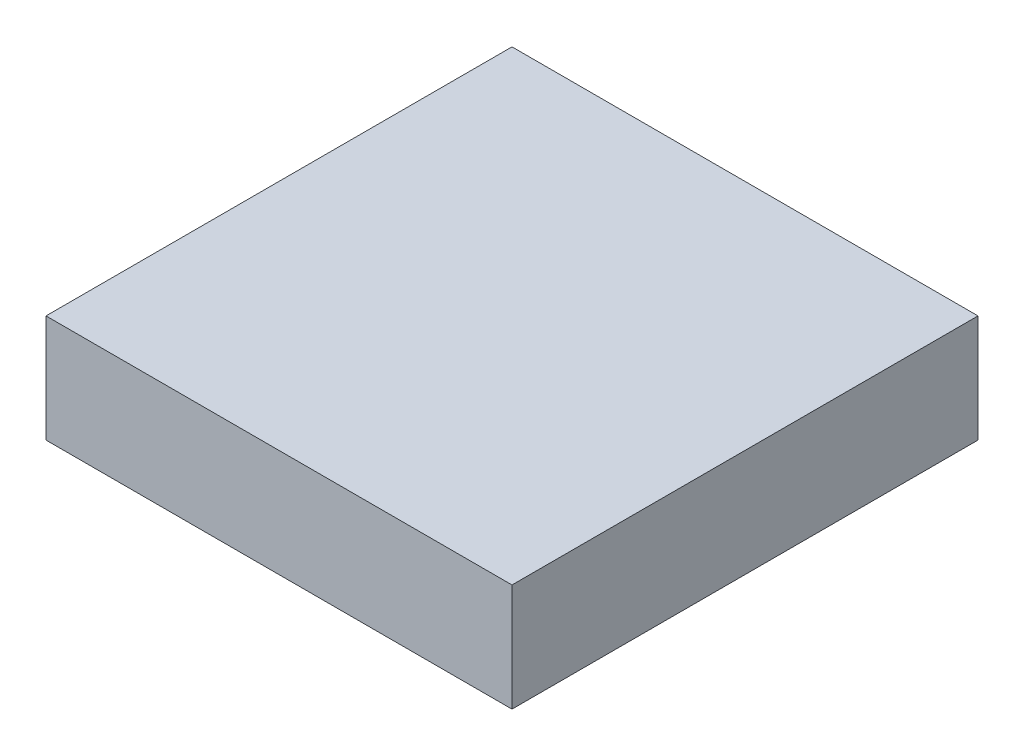
ISO-10303-21;
HEADER;
FILE_DESCRIPTION(('STEP AP214'),'2;1');
FILE_NAME('part.step','',(''),(''),'','','');
FILE_SCHEMA(('AUTOMOTIVE_DESIGN { 1 0 10303 214 1 1 1 1 }'));
ENDSEC;
DATA;
#1=APPLICATION_CONTEXT('core data for automotive mechanical design processes');
#2=APPLICATION_PROTOCOL_DEFINITION('international standard','automotive_design',2000,#1);
#3=PRODUCT_CONTEXT('',#1,'mechanical');
#4=PRODUCT('Part','Part','',(#3));
#5=PRODUCT_RELATED_PRODUCT_CATEGORY('part','',(#4));
#6=PRODUCT_DEFINITION_FORMATION('','',#4);
#7=PRODUCT_DEFINITION_CONTEXT('part definition',#1,'design');
#8=PRODUCT_DEFINITION('design','',#6,#7);
#9=PRODUCT_DEFINITION_SHAPE('','',#8);
#10=(LENGTH_UNIT() NAMED_UNIT(*) SI_UNIT(.MILLI.,.METRE.));
#11=(NAMED_UNIT(*) PLANE_ANGLE_UNIT() SI_UNIT($,.RADIAN.));
#12=(NAMED_UNIT(*) SI_UNIT($,.STERADIAN.) SOLID_ANGLE_UNIT());
#13=UNCERTAINTY_MEASURE_WITH_UNIT(LENGTH_MEASURE(1.E-05),#10,'distance_accuracy_value','');
#14=(GEOMETRIC_REPRESENTATION_CONTEXT(3) GLOBAL_UNCERTAINTY_ASSIGNED_CONTEXT((#13)) GLOBAL_UNIT_ASSIGNED_CONTEXT((#10,
#11,#12)) REPRESENTATION_CONTEXT('',''));
#15=CARTESIAN_POINT('',(0.,0.,0.));
#16=DIRECTION('',(0.,0.,1.));
#17=DIRECTION('',(1.,0.,0.));
#18=AXIS2_PLACEMENT_3D('',#15,#16,#17);
#19=CARTESIAN_POINT('',(0.,27.7,0.));
#20=DIRECTION('',(1.,0.,0.));
#21=DIRECTION('',(0.,0.,-1.));
#22=AXIS2_PLACEMENT_3D('',#19,#20,#21);
#23=PLANE('',#22);
#24=DIRECTION('',(0.,0.,1.));
#25=VECTOR('',#24,1.);
#26=CARTESIAN_POINT('',(0.,0.,0.));
#27=LINE('',#26,#25);
#28=CARTESIAN_POINT('',(0.,0.,-120.));
#29=VERTEX_POINT('',#28);
#30=CARTESIAN_POINT('',(0.,0.,0.));
#31=VERTEX_POINT('',#30);
#32=EDGE_CURVE('E96',#29,#31,#27,.T.);
#33=ORIENTED_EDGE('',*,*,#32,.T.);
#34=DIRECTION('',(0.,-1.,0.));
#35=VECTOR('',#34,1.);
#36=CARTESIAN_POINT('',(0.,27.7,0.));
#37=LINE('',#36,#35);
#38=CARTESIAN_POINT('',(0.,27.7,0.));
#39=VERTEX_POINT('',#38);
#40=EDGE_CURVE('E11',#39,#31,#37,.T.);
#41=ORIENTED_EDGE('',*,*,#40,.F.);
#42=DIRECTION('',(0.,0.,1.));
#43=VECTOR('',#42,1.);
#44=CARTESIAN_POINT('',(0.,27.7,0.));
#45=LINE('',#44,#43);
#46=CARTESIAN_POINT('',(0.,27.7,-120.));
#47=VERTEX_POINT('',#46);
#48=EDGE_CURVE('E84',#47,#39,#45,.T.);
#49=ORIENTED_EDGE('',*,*,#48,.F.);
#50=DIRECTION('',(0.,-1.,0.));
#51=VECTOR('',#50,1.);
#52=CARTESIAN_POINT('',(0.,27.7,-120.));
#53=LINE('',#52,#51);
#54=EDGE_CURVE('E92',#47,#29,#53,.T.);
#55=ORIENTED_EDGE('',*,*,#54,.T.);
#56=EDGE_LOOP('',(#33,#41,#49,#55));
#57=FACE_BOUND('',#56,.T.);
#58=ADVANCED_FACE('F33',(#57),#23,.F.);
#59=CARTESIAN_POINT('',(0.,27.7,0.));
#60=DIRECTION('',(0.,0.,-1.));
#61=DIRECTION('',(-1.,0.,0.));
#62=AXIS2_PLACEMENT_3D('',#59,#60,#61);
#63=PLANE('',#62);
#64=DIRECTION('',(1.,0.,0.));
#65=VECTOR('',#64,1.);
#66=CARTESIAN_POINT('',(0.,0.,0.));
#67=LINE('',#66,#65);
#68=CARTESIAN_POINT('',(120.,0.,0.));
#69=VERTEX_POINT('',#68);
#70=EDGE_CURVE('E88',#31,#69,#67,.T.);
#71=ORIENTED_EDGE('',*,*,#70,.T.);
#72=DIRECTION('',(0.,-1.,0.));
#73=VECTOR('',#72,1.);
#74=CARTESIAN_POINT('',(120.,27.7,0.));
#75=LINE('',#74,#73);
#76=CARTESIAN_POINT('',(120.,27.7,0.));
#77=VERTEX_POINT('',#76);
#78=EDGE_CURVE('E41',#77,#69,#75,.T.);
#79=ORIENTED_EDGE('',*,*,#78,.F.);
#80=DIRECTION('',(1.,0.,0.));
#81=VECTOR('',#80,1.);
#82=CARTESIAN_POINT('',(0.,27.7,0.));
#83=LINE('',#82,#81);
#84=EDGE_CURVE('E79',#39,#77,#83,.T.);
#85=ORIENTED_EDGE('',*,*,#84,.F.);
#86=ORIENTED_EDGE('',*,*,#40,.T.);
#87=EDGE_LOOP('',(#71,#79,#85,#86));
#88=FACE_BOUND('',#87,.T.);
#89=ADVANCED_FACE('F87',(#88),#63,.F.);
#90=CARTESIAN_POINT('',(120.,27.7,0.));
#91=DIRECTION('',(-1.,0.,0.));
#92=DIRECTION('',(0.,0.,1.));
#93=AXIS2_PLACEMENT_3D('',#90,#91,#92);
#94=PLANE('',#93);
#95=DIRECTION('',(0.,0.,-1.));
#96=VECTOR('',#95,1.);
#97=CARTESIAN_POINT('',(120.,0.,0.));
#98=LINE('',#97,#96);
#99=CARTESIAN_POINT('',(120.,0.,-120.));
#100=VERTEX_POINT('',#99);
#101=EDGE_CURVE('E66',#69,#100,#98,.T.);
#102=ORIENTED_EDGE('',*,*,#101,.T.);
#103=DIRECTION('',(0.,-1.,0.));
#104=VECTOR('',#103,1.);
#105=CARTESIAN_POINT('',(120.,27.7,-120.));
#106=LINE('',#105,#104);
#107=CARTESIAN_POINT('',(120.,27.7,-120.));
#108=VERTEX_POINT('',#107);
#109=EDGE_CURVE('E89',#108,#100,#106,.T.);
#110=ORIENTED_EDGE('',*,*,#109,.F.);
#111=DIRECTION('',(0.,0.,-1.));
#112=VECTOR('',#111,1.);
#113=CARTESIAN_POINT('',(120.,27.7,0.));
#114=LINE('',#113,#112);
#115=EDGE_CURVE('E82',#77,#108,#114,.T.);
#116=ORIENTED_EDGE('',*,*,#115,.F.);
#117=ORIENTED_EDGE('',*,*,#78,.T.);
#118=EDGE_LOOP('',(#102,#110,#116,#117));
#119=FACE_BOUND('',#118,.T.);
#120=ADVANCED_FACE('F90',(#119),#94,.F.);
#121=CARTESIAN_POINT('',(0.,27.7,-120.));
#122=DIRECTION('',(0.,0.,1.));
#123=DIRECTION('',(1.,0.,0.));
#124=AXIS2_PLACEMENT_3D('',#121,#122,#123);
#125=PLANE('',#124);
#126=DIRECTION('',(-1.,0.,0.));
#127=VECTOR('',#126,1.);
#128=CARTESIAN_POINT('',(0.,0.,-120.));
#129=LINE('',#128,#127);
#130=EDGE_CURVE('E72',#100,#29,#129,.T.);
#131=ORIENTED_EDGE('',*,*,#130,.T.);
#132=ORIENTED_EDGE('',*,*,#54,.F.);
#133=DIRECTION('',(-1.,0.,0.));
#134=VECTOR('',#133,1.);
#135=CARTESIAN_POINT('',(0.,27.7,-120.));
#136=LINE('',#135,#134);
#137=EDGE_CURVE('E49',#108,#47,#136,.T.);
#138=ORIENTED_EDGE('',*,*,#137,.F.);
#139=ORIENTED_EDGE('',*,*,#109,.T.);
#140=EDGE_LOOP('',(#131,#132,#138,#139));
#141=FACE_BOUND('',#140,.T.);
#142=ADVANCED_FACE('F103',(#141),#125,.F.);
#143=CARTESIAN_POINT('',(0.,27.7,0.));
#144=DIRECTION('',(0.,-1.,0.));
#145=DIRECTION('',(0.,0.,-1.));
#146=AXIS2_PLACEMENT_3D('',#143,#144,#145);
#147=PLANE('',#146);
#148=ORIENTED_EDGE('',*,*,#48,.T.);
#149=ORIENTED_EDGE('',*,*,#84,.T.);
#150=ORIENTED_EDGE('',*,*,#115,.T.);
#151=ORIENTED_EDGE('',*,*,#137,.T.);
#152=EDGE_LOOP('',(#148,#149,#150,#151));
#153=FACE_BOUND('',#152,.T.);
#154=ADVANCED_FACE('F80',(#153),#147,.F.);
#155=CARTESIAN_POINT('',(0.,0.,0.));
#156=DIRECTION('',(0.,-1.,0.));
#157=DIRECTION('',(0.,0.,-1.));
#158=AXIS2_PLACEMENT_3D('',#155,#156,#157);
#159=PLANE('',#158);
#160=ORIENTED_EDGE('',*,*,#32,.F.);
#161=ORIENTED_EDGE('',*,*,#130,.F.);
#162=ORIENTED_EDGE('',*,*,#101,.F.);
#163=ORIENTED_EDGE('',*,*,#70,.F.);
#164=EDGE_LOOP('',(#160,#161,#162,#163));
#165=FACE_BOUND('',#164,.T.);
#166=ADVANCED_FACE('F106',(#165),#159,.T.);
#167=CLOSED_SHELL('',(#58,#89,#120,#142,#154,#166));
#168=MANIFOLD_SOLID_BREP('B2',#167);
#169=ADVANCED_BREP_SHAPE_REPRESENTATION('',(#18,#168),#14);
#170=SHAPE_DEFINITION_REPRESENTATION(#9,#169);
ENDSEC;
END-ISO-10303-21;
